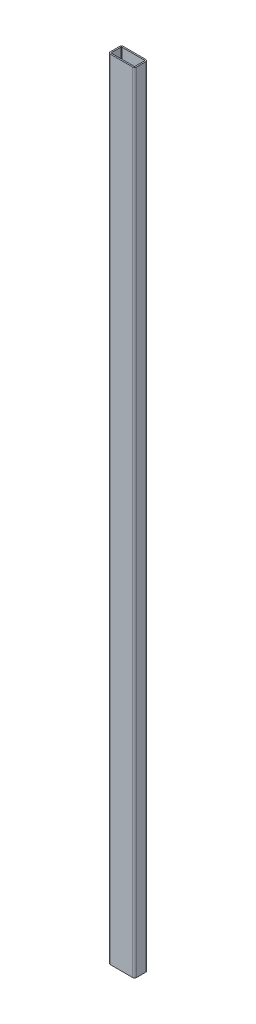
ISO-10303-21;
HEADER;
FILE_DESCRIPTION(('STEP AP214'),'2;1');
FILE_NAME('part.step','',(''),(''),'','','');
FILE_SCHEMA(('AUTOMOTIVE_DESIGN { 1 0 10303 214 1 1 1 1 }'));
ENDSEC;
DATA;
#1=APPLICATION_CONTEXT('core data for automotive mechanical design processes');
#2=APPLICATION_PROTOCOL_DEFINITION('international standard','automotive_design',2000,#1);
#3=PRODUCT_CONTEXT('',#1,'mechanical');
#4=PRODUCT('Part','Part','',(#3));
#5=PRODUCT_RELATED_PRODUCT_CATEGORY('part','',(#4));
#6=PRODUCT_DEFINITION_FORMATION('','',#4);
#7=PRODUCT_DEFINITION_CONTEXT('part definition',#1,'design');
#8=PRODUCT_DEFINITION('design','',#6,#7);
#9=PRODUCT_DEFINITION_SHAPE('','',#8);
#10=(LENGTH_UNIT() NAMED_UNIT(*) SI_UNIT(.MILLI.,.METRE.));
#11=(NAMED_UNIT(*) PLANE_ANGLE_UNIT() SI_UNIT($,.RADIAN.));
#12=(NAMED_UNIT(*) SI_UNIT($,.STERADIAN.) SOLID_ANGLE_UNIT());
#13=UNCERTAINTY_MEASURE_WITH_UNIT(LENGTH_MEASURE(1.E-05),#10,'distance_accuracy_value','');
#14=(GEOMETRIC_REPRESENTATION_CONTEXT(3) GLOBAL_UNCERTAINTY_ASSIGNED_CONTEXT((#13)) GLOBAL_UNIT_ASSIGNED_CONTEXT((#10,
#11,#12)) REPRESENTATION_CONTEXT('',''));
#15=CARTESIAN_POINT('',(0.,0.,0.));
#16=DIRECTION('',(0.,0.,1.));
#17=DIRECTION('',(1.,0.,0.));
#18=AXIS2_PLACEMENT_3D('',#15,#16,#17);
#19=CARTESIAN_POINT('',(37.,1200.,-3.));
#20=DIRECTION('',(0.,1.,0.));
#21=DIRECTION('',(0.,0.,1.));
#22=AXIS2_PLACEMENT_3D('',#19,#20,#21);
#23=PLANE('',#22);
#24=CARTESIAN_POINT('',(37.,1200.,-3.));
#25=DIRECTION('',(0.,1.,0.));
#26=DIRECTION('',(0.,0.,1.));
#27=AXIS2_PLACEMENT_3D('',#24,#25,#26);
#28=CIRCLE('',#27,3.);
#29=CARTESIAN_POINT('',(37.,1200.,0.));
#30=VERTEX_POINT('',#29);
#31=CARTESIAN_POINT('',(40.,1200.,-3.00000000000002));
#32=VERTEX_POINT('',#31);
#33=EDGE_CURVE('E262',#30,#32,#28,.T.);
#34=ORIENTED_EDGE('',*,*,#33,.T.);
#35=DIRECTION('',(0.,0.,-1.));
#36=VECTOR('',#35,1.);
#37=CARTESIAN_POINT('',(40.,1200.,-3.00000000000002));
#38=LINE('',#37,#36);
#39=CARTESIAN_POINT('',(40.,1200.,-17.));
#40=VERTEX_POINT('',#39);
#41=EDGE_CURVE('E265',#32,#40,#38,.T.);
#42=ORIENTED_EDGE('',*,*,#41,.T.);
#43=CARTESIAN_POINT('',(37.,1200.,-17.));
#44=DIRECTION('',(0.,1.,0.));
#45=DIRECTION('',(0.,0.,1.));
#46=AXIS2_PLACEMENT_3D('',#43,#44,#45);
#47=CIRCLE('',#46,3.);
#48=CARTESIAN_POINT('',(37.,1200.,-20.));
#49=VERTEX_POINT('',#48);
#50=EDGE_CURVE('E268',#40,#49,#47,.T.);
#51=ORIENTED_EDGE('',*,*,#50,.T.);
#52=DIRECTION('',(-1.,0.,0.));
#53=VECTOR('',#52,1.);
#54=CARTESIAN_POINT('',(3.00000000000002,1200.,-20.));
#55=LINE('',#54,#53);
#56=CARTESIAN_POINT('',(3.,1200.,-20.));
#57=VERTEX_POINT('',#56);
#58=EDGE_CURVE('E270',#49,#57,#55,.T.);
#59=ORIENTED_EDGE('',*,*,#58,.T.);
#60=CARTESIAN_POINT('',(3.,1200.,-17.));
#61=DIRECTION('',(0.,1.,0.));
#62=DIRECTION('',(0.,0.,-1.));
#63=AXIS2_PLACEMENT_3D('',#60,#61,#62);
#64=CIRCLE('',#63,3.);
#65=CARTESIAN_POINT('',(0.,1200.,-17.));
#66=VERTEX_POINT('',#65);
#67=EDGE_CURVE('E272',#57,#66,#64,.T.);
#68=ORIENTED_EDGE('',*,*,#67,.T.);
#69=DIRECTION('',(0.,0.,1.));
#70=VECTOR('',#69,1.);
#71=CARTESIAN_POINT('',(0.,1200.,-3.00000000000002));
#72=LINE('',#71,#70);
#73=CARTESIAN_POINT('',(0.,1200.,-3.00000000000002));
#74=VERTEX_POINT('',#73);
#75=EDGE_CURVE('E274',#66,#74,#72,.T.);
#76=ORIENTED_EDGE('',*,*,#75,.T.);
#77=CARTESIAN_POINT('',(3.,1200.,-3.));
#78=DIRECTION('',(0.,1.,0.));
#79=DIRECTION('',(0.,0.,1.));
#80=AXIS2_PLACEMENT_3D('',#77,#78,#79);
#81=CIRCLE('',#80,3.);
#82=CARTESIAN_POINT('',(3.00000000000002,1200.,0.));
#83=VERTEX_POINT('',#82);
#84=EDGE_CURVE('E276',#74,#83,#81,.T.);
#85=ORIENTED_EDGE('',*,*,#84,.T.);
#86=DIRECTION('',(1.,0.,0.));
#87=VECTOR('',#86,1.);
#88=CARTESIAN_POINT('',(3.00000000000002,1200.,0.));
#89=LINE('',#88,#87);
#90=EDGE_CURVE('E278',#83,#30,#89,.T.);
#91=ORIENTED_EDGE('',*,*,#90,.T.);
#92=EDGE_LOOP('',(#34,#42,#51,#59,#68,#76,#85,#91));
#93=FACE_BOUND('',#92,.T.);
#94=DIRECTION('',(0.,0.,-1.));
#95=VECTOR('',#94,1.);
#96=CARTESIAN_POINT('',(38.,1200.,-3.00000000000002));
#97=LINE('',#96,#95);
#98=CARTESIAN_POINT('',(38.,1200.,-3.00000000000002));
#99=VERTEX_POINT('',#98);
#100=CARTESIAN_POINT('',(38.,1200.,-17.));
#101=VERTEX_POINT('',#100);
#102=EDGE_CURVE('E205',#99,#101,#97,.T.);
#103=ORIENTED_EDGE('',*,*,#102,.F.);
#104=CARTESIAN_POINT('',(37.,1200.,-3.));
#105=DIRECTION('',(0.,1.,0.));
#106=DIRECTION('',(1.,0.,0.));
#107=AXIS2_PLACEMENT_3D('',#104,#105,#106);
#108=CIRCLE('',#107,1.);
#109=CARTESIAN_POINT('',(37.,1200.,-2.));
#110=VERTEX_POINT('',#109);
#111=EDGE_CURVE('E197',#110,#99,#108,.T.);
#112=ORIENTED_EDGE('',*,*,#111,.F.);
#113=DIRECTION('',(1.,0.,0.));
#114=VECTOR('',#113,1.);
#115=CARTESIAN_POINT('',(3.00000000000002,1200.,-2.));
#116=LINE('',#115,#114);
#117=CARTESIAN_POINT('',(3.00000000000001,1200.,-2.));
#118=VERTEX_POINT('',#117);
#119=EDGE_CURVE('E230',#118,#110,#116,.T.);
#120=ORIENTED_EDGE('',*,*,#119,.F.);
#121=CARTESIAN_POINT('',(3.,1200.,-3.));
#122=DIRECTION('',(0.,1.,0.));
#123=DIRECTION('',(1.,0.,0.));
#124=AXIS2_PLACEMENT_3D('',#121,#122,#123);
#125=CIRCLE('',#124,1.);
#126=CARTESIAN_POINT('',(2.,1200.,-3.00000000000002));
#127=VERTEX_POINT('',#126);
#128=EDGE_CURVE('E228',#127,#118,#125,.T.);
#129=ORIENTED_EDGE('',*,*,#128,.F.);
#130=DIRECTION('',(0.,0.,1.));
#131=VECTOR('',#130,1.);
#132=CARTESIAN_POINT('',(2.,1200.,-3.00000000000002));
#133=LINE('',#132,#131);
#134=CARTESIAN_POINT('',(2.,1200.,-17.));
#135=VERTEX_POINT('',#134);
#136=EDGE_CURVE('E226',#135,#127,#133,.T.);
#137=ORIENTED_EDGE('',*,*,#136,.F.);
#138=CARTESIAN_POINT('',(3.,1200.,-17.));
#139=DIRECTION('',(0.,1.,0.));
#140=DIRECTION('',(1.,0.,0.));
#141=AXIS2_PLACEMENT_3D('',#138,#139,#140);
#142=CIRCLE('',#141,1.);
#143=CARTESIAN_POINT('',(3.,1200.,-18.));
#144=VERTEX_POINT('',#143);
#145=EDGE_CURVE('E224',#144,#135,#142,.T.);
#146=ORIENTED_EDGE('',*,*,#145,.F.);
#147=DIRECTION('',(-1.,0.,0.));
#148=VECTOR('',#147,1.);
#149=CARTESIAN_POINT('',(3.00000000000002,1200.,-18.));
#150=LINE('',#149,#148);
#151=CARTESIAN_POINT('',(37.,1200.,-18.));
#152=VERTEX_POINT('',#151);
#153=EDGE_CURVE('E220',#152,#144,#150,.T.);
#154=ORIENTED_EDGE('',*,*,#153,.F.);
#155=CARTESIAN_POINT('',(37.,1200.,-17.));
#156=DIRECTION('',(0.,1.,0.));
#157=DIRECTION('',(1.,0.,0.));
#158=AXIS2_PLACEMENT_3D('',#155,#156,#157);
#159=CIRCLE('',#158,1.);
#160=EDGE_CURVE('E218',#101,#152,#159,.T.);
#161=ORIENTED_EDGE('',*,*,#160,.F.);
#162=EDGE_LOOP('',(#103,#112,#120,#129,#137,#146,#154,#161));
#163=FACE_BOUND('',#162,.T.);
#164=ADVANCED_FACE('F84',(#93,#163),#23,.T.);
#165=CARTESIAN_POINT('',(37.,0.,-3.));
#166=DIRECTION('',(0.,1.,0.));
#167=DIRECTION('',(0.,0.,1.));
#168=AXIS2_PLACEMENT_3D('',#165,#166,#167);
#169=PLANE('',#168);
#170=CARTESIAN_POINT('',(37.,0.,-3.));
#171=DIRECTION('',(0.,1.,0.));
#172=DIRECTION('',(0.,0.,1.));
#173=AXIS2_PLACEMENT_3D('',#170,#171,#172);
#174=CIRCLE('',#173,3.);
#175=CARTESIAN_POINT('',(37.,0.,0.));
#176=VERTEX_POINT('',#175);
#177=CARTESIAN_POINT('',(40.,0.,-3.00000000000002));
#178=VERTEX_POINT('',#177);
#179=EDGE_CURVE('E213',#176,#178,#174,.T.);
#180=ORIENTED_EDGE('',*,*,#179,.F.);
#181=DIRECTION('',(1.,0.,0.));
#182=VECTOR('',#181,1.);
#183=CARTESIAN_POINT('',(3.00000000000002,0.,0.));
#184=LINE('',#183,#182);
#185=CARTESIAN_POINT('',(3.00000000000002,0.,0.));
#186=VERTEX_POINT('',#185);
#187=EDGE_CURVE('E266',#186,#176,#184,.T.);
#188=ORIENTED_EDGE('',*,*,#187,.F.);
#189=CARTESIAN_POINT('',(3.,0.,-3.));
#190=DIRECTION('',(0.,1.,0.));
#191=DIRECTION('',(0.,0.,1.));
#192=AXIS2_PLACEMENT_3D('',#189,#190,#191);
#193=CIRCLE('',#192,3.);
#194=CARTESIAN_POINT('',(0.,0.,-3.00000000000002));
#195=VERTEX_POINT('',#194);
#196=EDGE_CURVE('E293',#195,#186,#193,.T.);
#197=ORIENTED_EDGE('',*,*,#196,.F.);
#198=DIRECTION('',(0.,0.,1.));
#199=VECTOR('',#198,1.);
#200=CARTESIAN_POINT('',(0.,0.,-3.00000000000002));
#201=LINE('',#200,#199);
#202=CARTESIAN_POINT('',(0.,0.,-17.));
#203=VERTEX_POINT('',#202);
#204=EDGE_CURVE('E291',#203,#195,#201,.T.);
#205=ORIENTED_EDGE('',*,*,#204,.F.);
#206=CARTESIAN_POINT('',(3.,0.,-17.));
#207=DIRECTION('',(0.,1.,0.));
#208=DIRECTION('',(0.,0.,-1.));
#209=AXIS2_PLACEMENT_3D('',#206,#207,#208);
#210=CIRCLE('',#209,3.);
#211=CARTESIAN_POINT('',(3.,0.,-20.));
#212=VERTEX_POINT('',#211);
#213=EDGE_CURVE('E289',#212,#203,#210,.T.);
#214=ORIENTED_EDGE('',*,*,#213,.F.);
#215=DIRECTION('',(-1.,0.,0.));
#216=VECTOR('',#215,1.);
#217=CARTESIAN_POINT('',(3.00000000000002,0.,-20.));
#218=LINE('',#217,#216);
#219=CARTESIAN_POINT('',(37.,0.,-20.));
#220=VERTEX_POINT('',#219);
#221=EDGE_CURVE('E287',#220,#212,#218,.T.);
#222=ORIENTED_EDGE('',*,*,#221,.F.);
#223=CARTESIAN_POINT('',(37.,0.,-17.));
#224=DIRECTION('',(0.,1.,0.));
#225=DIRECTION('',(0.,0.,1.));
#226=AXIS2_PLACEMENT_3D('',#223,#224,#225);
#227=CIRCLE('',#226,3.);
#228=CARTESIAN_POINT('',(40.,0.,-17.));
#229=VERTEX_POINT('',#228);
#230=EDGE_CURVE('E285',#229,#220,#227,.T.);
#231=ORIENTED_EDGE('',*,*,#230,.F.);
#232=DIRECTION('',(0.,0.,-1.));
#233=VECTOR('',#232,1.);
#234=CARTESIAN_POINT('',(40.,0.,-3.00000000000002));
#235=LINE('',#234,#233);
#236=EDGE_CURVE('E283',#178,#229,#235,.T.);
#237=ORIENTED_EDGE('',*,*,#236,.F.);
#238=EDGE_LOOP('',(#180,#188,#197,#205,#214,#222,#231,#237));
#239=FACE_BOUND('',#238,.T.);
#240=CARTESIAN_POINT('',(37.,0.,-3.));
#241=DIRECTION('',(0.,1.,0.));
#242=DIRECTION('',(1.,0.,0.));
#243=AXIS2_PLACEMENT_3D('',#240,#241,#242);
#244=CIRCLE('',#243,1.);
#245=CARTESIAN_POINT('',(37.,0.,-2.));
#246=VERTEX_POINT('',#245);
#247=CARTESIAN_POINT('',(38.,0.,-3.00000000000002));
#248=VERTEX_POINT('',#247);
#249=EDGE_CURVE('E107',#246,#248,#244,.T.);
#250=ORIENTED_EDGE('',*,*,#249,.T.);
#251=DIRECTION('',(0.,0.,-1.));
#252=VECTOR('',#251,1.);
#253=CARTESIAN_POINT('',(38.,0.,-3.00000000000002));
#254=LINE('',#253,#252);
#255=CARTESIAN_POINT('',(38.,0.,-17.));
#256=VERTEX_POINT('',#255);
#257=EDGE_CURVE('E212',#248,#256,#254,.T.);
#258=ORIENTED_EDGE('',*,*,#257,.T.);
#259=CARTESIAN_POINT('',(37.,0.,-17.));
#260=DIRECTION('',(0.,1.,0.));
#261=DIRECTION('',(1.,0.,0.));
#262=AXIS2_PLACEMENT_3D('',#259,#260,#261);
#263=CIRCLE('',#262,1.);
#264=CARTESIAN_POINT('',(37.,0.,-18.));
#265=VERTEX_POINT('',#264);
#266=EDGE_CURVE('E234',#256,#265,#263,.T.);
#267=ORIENTED_EDGE('',*,*,#266,.T.);
#268=DIRECTION('',(-1.,0.,0.));
#269=VECTOR('',#268,1.);
#270=CARTESIAN_POINT('',(3.00000000000002,0.,-18.));
#271=LINE('',#270,#269);
#272=CARTESIAN_POINT('',(3.,0.,-18.));
#273=VERTEX_POINT('',#272);
#274=EDGE_CURVE('E237',#265,#273,#271,.T.);
#275=ORIENTED_EDGE('',*,*,#274,.T.);
#276=CARTESIAN_POINT('',(3.,0.,-17.));
#277=DIRECTION('',(0.,1.,0.));
#278=DIRECTION('',(1.,0.,0.));
#279=AXIS2_PLACEMENT_3D('',#276,#277,#278);
#280=CIRCLE('',#279,1.);
#281=CARTESIAN_POINT('',(2.,0.,-17.));
#282=VERTEX_POINT('',#281);
#283=EDGE_CURVE('E240',#273,#282,#280,.T.);
#284=ORIENTED_EDGE('',*,*,#283,.T.);
#285=DIRECTION('',(0.,0.,1.));
#286=VECTOR('',#285,1.);
#287=CARTESIAN_POINT('',(2.,0.,-3.00000000000002));
#288=LINE('',#287,#286);
#289=CARTESIAN_POINT('',(2.,0.,-3.00000000000002));
#290=VERTEX_POINT('',#289);
#291=EDGE_CURVE('E243',#282,#290,#288,.T.);
#292=ORIENTED_EDGE('',*,*,#291,.T.);
#293=CARTESIAN_POINT('',(3.,0.,-3.));
#294=DIRECTION('',(0.,1.,0.));
#295=DIRECTION('',(1.,0.,0.));
#296=AXIS2_PLACEMENT_3D('',#293,#294,#295);
#297=CIRCLE('',#296,1.);
#298=CARTESIAN_POINT('',(3.00000000000001,0.,-2.));
#299=VERTEX_POINT('',#298);
#300=EDGE_CURVE('E246',#290,#299,#297,.T.);
#301=ORIENTED_EDGE('',*,*,#300,.T.);
#302=DIRECTION('',(1.,0.,0.));
#303=VECTOR('',#302,1.);
#304=CARTESIAN_POINT('',(3.00000000000002,0.,-2.));
#305=LINE('',#304,#303);
#306=EDGE_CURVE('E206',#299,#246,#305,.T.);
#307=ORIENTED_EDGE('',*,*,#306,.T.);
#308=EDGE_LOOP('',(#250,#258,#267,#275,#284,#292,#301,#307));
#309=FACE_BOUND('',#308,.T.);
#310=ADVANCED_FACE('F323',(#239,#309),#169,.F.);
#311=CARTESIAN_POINT('',(37.,1200.,-3.));
#312=DIRECTION('',(0.,-1.,0.));
#313=DIRECTION('',(0.,0.,-1.));
#314=AXIS2_PLACEMENT_3D('',#311,#312,#313);
#315=CYLINDRICAL_SURFACE('',#314,3.);
#316=ORIENTED_EDGE('',*,*,#179,.T.);
#317=DIRECTION('',(0.,-1.,0.));
#318=VECTOR('',#317,1.);
#319=CARTESIAN_POINT('',(40.,1200.,-3.00000000000002));
#320=LINE('',#319,#318);
#321=EDGE_CURVE('E12',#32,#178,#320,.T.);
#322=ORIENTED_EDGE('',*,*,#321,.F.);
#323=ORIENTED_EDGE('',*,*,#33,.F.);
#324=DIRECTION('',(0.,-1.,0.));
#325=VECTOR('',#324,1.);
#326=CARTESIAN_POINT('',(37.,1200.,0.));
#327=LINE('',#326,#325);
#328=EDGE_CURVE('E280',#30,#176,#327,.T.);
#329=ORIENTED_EDGE('',*,*,#328,.T.);
#330=EDGE_LOOP('',(#316,#322,#323,#329));
#331=FACE_BOUND('',#330,.T.);
#332=ADVANCED_FACE('F86',(#331),#315,.T.);
#333=CARTESIAN_POINT('',(40.,1200.,-3.00000000000002));
#334=DIRECTION('',(-1.,0.,0.));
#335=DIRECTION('',(0.,0.,1.));
#336=AXIS2_PLACEMENT_3D('',#333,#334,#335);
#337=PLANE('',#336);
#338=ORIENTED_EDGE('',*,*,#236,.T.);
#339=DIRECTION('',(0.,-1.,0.));
#340=VECTOR('',#339,1.);
#341=CARTESIAN_POINT('',(40.,1200.,-17.));
#342=LINE('',#341,#340);
#343=EDGE_CURVE('E92',#40,#229,#342,.T.);
#344=ORIENTED_EDGE('',*,*,#343,.F.);
#345=ORIENTED_EDGE('',*,*,#41,.F.);
#346=ORIENTED_EDGE('',*,*,#321,.T.);
#347=EDGE_LOOP('',(#338,#344,#345,#346));
#348=FACE_BOUND('',#347,.T.);
#349=ADVANCED_FACE('F340',(#348),#337,.F.);
#350=CARTESIAN_POINT('',(37.,1200.,-17.));
#351=DIRECTION('',(0.,-1.,0.));
#352=DIRECTION('',(0.,0.,-1.));
#353=AXIS2_PLACEMENT_3D('',#350,#351,#352);
#354=CYLINDRICAL_SURFACE('',#353,3.);
#355=ORIENTED_EDGE('',*,*,#230,.T.);
#356=DIRECTION('',(0.,-1.,0.));
#357=VECTOR('',#356,1.);
#358=CARTESIAN_POINT('',(37.,1200.,-20.));
#359=LINE('',#358,#357);
#360=EDGE_CURVE('E310',#49,#220,#359,.T.);
#361=ORIENTED_EDGE('',*,*,#360,.F.);
#362=ORIENTED_EDGE('',*,*,#50,.F.);
#363=ORIENTED_EDGE('',*,*,#343,.T.);
#364=EDGE_LOOP('',(#355,#361,#362,#363));
#365=FACE_BOUND('',#364,.T.);
#366=ADVANCED_FACE('F317',(#365),#354,.T.);
#367=CARTESIAN_POINT('',(3.00000000000002,1200.,-20.));
#368=DIRECTION('',(0.,0.,1.));
#369=DIRECTION('',(1.,0.,0.));
#370=AXIS2_PLACEMENT_3D('',#367,#368,#369);
#371=PLANE('',#370);
#372=ORIENTED_EDGE('',*,*,#221,.T.);
#373=DIRECTION('',(0.,-1.,0.));
#374=VECTOR('',#373,1.);
#375=CARTESIAN_POINT('',(3.,1200.,-20.));
#376=LINE('',#375,#374);
#377=EDGE_CURVE('E307',#57,#212,#376,.T.);
#378=ORIENTED_EDGE('',*,*,#377,.F.);
#379=ORIENTED_EDGE('',*,*,#58,.F.);
#380=ORIENTED_EDGE('',*,*,#360,.T.);
#381=EDGE_LOOP('',(#372,#378,#379,#380));
#382=FACE_BOUND('',#381,.T.);
#383=ADVANCED_FACE('F329',(#382),#371,.F.);
#384=CARTESIAN_POINT('',(3.,1200.,-17.));
#385=DIRECTION('',(0.,-1.,0.));
#386=DIRECTION('',(0.,0.,-1.));
#387=AXIS2_PLACEMENT_3D('',#384,#385,#386);
#388=CYLINDRICAL_SURFACE('',#387,3.);
#389=ORIENTED_EDGE('',*,*,#213,.T.);
#390=DIRECTION('',(0.,-1.,0.));
#391=VECTOR('',#390,1.);
#392=CARTESIAN_POINT('',(0.,1200.,-17.));
#393=LINE('',#392,#391);
#394=EDGE_CURVE('E304',#66,#203,#393,.T.);
#395=ORIENTED_EDGE('',*,*,#394,.F.);
#396=ORIENTED_EDGE('',*,*,#67,.F.);
#397=ORIENTED_EDGE('',*,*,#377,.T.);
#398=EDGE_LOOP('',(#389,#395,#396,#397));
#399=FACE_BOUND('',#398,.T.);
#400=ADVANCED_FACE('F333',(#399),#388,.T.);
#401=CARTESIAN_POINT('',(0.,1200.,-3.00000000000002));
#402=DIRECTION('',(1.,0.,0.));
#403=DIRECTION('',(0.,0.,-1.));
#404=AXIS2_PLACEMENT_3D('',#401,#402,#403);
#405=PLANE('',#404);
#406=ORIENTED_EDGE('',*,*,#204,.T.);
#407=DIRECTION('',(0.,-1.,0.));
#408=VECTOR('',#407,1.);
#409=CARTESIAN_POINT('',(0.,1200.,-3.00000000000002));
#410=LINE('',#409,#408);
#411=EDGE_CURVE('E301',#74,#195,#410,.T.);
#412=ORIENTED_EDGE('',*,*,#411,.F.);
#413=ORIENTED_EDGE('',*,*,#75,.F.);
#414=ORIENTED_EDGE('',*,*,#394,.T.);
#415=EDGE_LOOP('',(#406,#412,#413,#414));
#416=FACE_BOUND('',#415,.T.);
#417=ADVANCED_FACE('F353',(#416),#405,.F.);
#418=CARTESIAN_POINT('',(3.,1200.,-3.));
#419=DIRECTION('',(0.,-1.,0.));
#420=DIRECTION('',(0.,0.,-1.));
#421=AXIS2_PLACEMENT_3D('',#418,#419,#420);
#422=CYLINDRICAL_SURFACE('',#421,3.);
#423=ORIENTED_EDGE('',*,*,#196,.T.);
#424=DIRECTION('',(0.,-1.,0.));
#425=VECTOR('',#424,1.);
#426=CARTESIAN_POINT('',(3.00000000000002,1200.,0.));
#427=LINE('',#426,#425);
#428=EDGE_CURVE('E298',#83,#186,#427,.T.);
#429=ORIENTED_EDGE('',*,*,#428,.F.);
#430=ORIENTED_EDGE('',*,*,#84,.F.);
#431=ORIENTED_EDGE('',*,*,#411,.T.);
#432=EDGE_LOOP('',(#423,#429,#430,#431));
#433=FACE_BOUND('',#432,.T.);
#434=ADVANCED_FACE('F351',(#433),#422,.T.);
#435=CARTESIAN_POINT('',(3.00000000000002,1200.,0.));
#436=DIRECTION('',(0.,0.,-1.));
#437=DIRECTION('',(-1.,0.,0.));
#438=AXIS2_PLACEMENT_3D('',#435,#436,#437);
#439=PLANE('',#438);
#440=ORIENTED_EDGE('',*,*,#187,.T.);
#441=ORIENTED_EDGE('',*,*,#328,.F.);
#442=ORIENTED_EDGE('',*,*,#90,.F.);
#443=ORIENTED_EDGE('',*,*,#428,.T.);
#444=EDGE_LOOP('',(#440,#441,#442,#443));
#445=FACE_BOUND('',#444,.T.);
#446=ADVANCED_FACE('F346',(#445),#439,.F.);
#447=CARTESIAN_POINT('',(37.,1200.,-3.));
#448=DIRECTION('',(0.,-1.,0.));
#449=DIRECTION('',(0.,0.,-1.));
#450=AXIS2_PLACEMENT_3D('',#447,#448,#449);
#451=CYLINDRICAL_SURFACE('',#450,1.);
#452=ORIENTED_EDGE('',*,*,#249,.F.);
#453=DIRECTION('',(0.,-1.,0.));
#454=VECTOR('',#453,1.);
#455=CARTESIAN_POINT('',(37.,1200.,-2.));
#456=LINE('',#455,#454);
#457=EDGE_CURVE('E201',#110,#246,#456,.T.);
#458=ORIENTED_EDGE('',*,*,#457,.F.);
#459=ORIENTED_EDGE('',*,*,#111,.T.);
#460=DIRECTION('',(0.,-1.,0.));
#461=VECTOR('',#460,1.);
#462=CARTESIAN_POINT('',(38.,1200.,-3.00000000000002));
#463=LINE('',#462,#461);
#464=EDGE_CURVE('E200',#99,#248,#463,.T.);
#465=ORIENTED_EDGE('',*,*,#464,.T.);
#466=EDGE_LOOP('',(#452,#458,#459,#465));
#467=FACE_BOUND('',#466,.T.);
#468=ADVANCED_FACE('F199',(#467),#451,.F.);
#469=CARTESIAN_POINT('',(38.,1200.,-3.00000000000002));
#470=DIRECTION('',(-1.,0.,0.));
#471=DIRECTION('',(0.,0.,1.));
#472=AXIS2_PLACEMENT_3D('',#469,#470,#471);
#473=PLANE('',#472);
#474=ORIENTED_EDGE('',*,*,#257,.F.);
#475=ORIENTED_EDGE('',*,*,#464,.F.);
#476=ORIENTED_EDGE('',*,*,#102,.T.);
#477=DIRECTION('',(0.,-1.,0.));
#478=VECTOR('',#477,1.);
#479=CARTESIAN_POINT('',(38.,1200.,-17.));
#480=LINE('',#479,#478);
#481=EDGE_CURVE('E214',#101,#256,#480,.T.);
#482=ORIENTED_EDGE('',*,*,#481,.T.);
#483=EDGE_LOOP('',(#474,#475,#476,#482));
#484=FACE_BOUND('',#483,.T.);
#485=ADVANCED_FACE('F209',(#484),#473,.T.);
#486=CARTESIAN_POINT('',(37.,1200.,-17.));
#487=DIRECTION('',(0.,-1.,0.));
#488=DIRECTION('',(0.,0.,-1.));
#489=AXIS2_PLACEMENT_3D('',#486,#487,#488);
#490=CYLINDRICAL_SURFACE('',#489,1.);
#491=ORIENTED_EDGE('',*,*,#266,.F.);
#492=ORIENTED_EDGE('',*,*,#481,.F.);
#493=ORIENTED_EDGE('',*,*,#160,.T.);
#494=DIRECTION('',(0.,-1.,0.));
#495=VECTOR('',#494,1.);
#496=CARTESIAN_POINT('',(37.,1200.,-18.));
#497=LINE('',#496,#495);
#498=EDGE_CURVE('E259',#152,#265,#497,.T.);
#499=ORIENTED_EDGE('',*,*,#498,.T.);
#500=EDGE_LOOP('',(#491,#492,#493,#499));
#501=FACE_BOUND('',#500,.T.);
#502=ADVANCED_FACE('F378',(#501),#490,.F.);
#503=CARTESIAN_POINT('',(3.00000000000002,1200.,-18.));
#504=DIRECTION('',(0.,0.,1.));
#505=DIRECTION('',(1.,0.,0.));
#506=AXIS2_PLACEMENT_3D('',#503,#504,#505);
#507=PLANE('',#506);
#508=ORIENTED_EDGE('',*,*,#274,.F.);
#509=ORIENTED_EDGE('',*,*,#498,.F.);
#510=ORIENTED_EDGE('',*,*,#153,.T.);
#511=DIRECTION('',(0.,-1.,0.));
#512=VECTOR('',#511,1.);
#513=CARTESIAN_POINT('',(3.,1200.,-18.));
#514=LINE('',#513,#512);
#515=EDGE_CURVE('E257',#144,#273,#514,.T.);
#516=ORIENTED_EDGE('',*,*,#515,.T.);
#517=EDGE_LOOP('',(#508,#509,#510,#516));
#518=FACE_BOUND('',#517,.T.);
#519=ADVANCED_FACE('F382',(#518),#507,.T.);
#520=CARTESIAN_POINT('',(3.,1200.,-17.));
#521=DIRECTION('',(0.,-1.,0.));
#522=DIRECTION('',(0.,0.,-1.));
#523=AXIS2_PLACEMENT_3D('',#520,#521,#522);
#524=CYLINDRICAL_SURFACE('',#523,1.);
#525=ORIENTED_EDGE('',*,*,#283,.F.);
#526=ORIENTED_EDGE('',*,*,#515,.F.);
#527=ORIENTED_EDGE('',*,*,#145,.T.);
#528=DIRECTION('',(0.,-1.,0.));
#529=VECTOR('',#528,1.);
#530=CARTESIAN_POINT('',(2.,1200.,-17.));
#531=LINE('',#530,#529);
#532=EDGE_CURVE('E255',#135,#282,#531,.T.);
#533=ORIENTED_EDGE('',*,*,#532,.T.);
#534=EDGE_LOOP('',(#525,#526,#527,#533));
#535=FACE_BOUND('',#534,.T.);
#536=ADVANCED_FACE('F388',(#535),#524,.F.);
#537=CARTESIAN_POINT('',(2.,1200.,-3.00000000000002));
#538=DIRECTION('',(1.,0.,0.));
#539=DIRECTION('',(0.,0.,-1.));
#540=AXIS2_PLACEMENT_3D('',#537,#538,#539);
#541=PLANE('',#540);
#542=ORIENTED_EDGE('',*,*,#291,.F.);
#543=ORIENTED_EDGE('',*,*,#532,.F.);
#544=ORIENTED_EDGE('',*,*,#136,.T.);
#545=DIRECTION('',(0.,-1.,0.));
#546=VECTOR('',#545,1.);
#547=CARTESIAN_POINT('',(2.,1200.,-3.00000000000002));
#548=LINE('',#547,#546);
#549=EDGE_CURVE('E253',#127,#290,#548,.T.);
#550=ORIENTED_EDGE('',*,*,#549,.T.);
#551=EDGE_LOOP('',(#542,#543,#544,#550));
#552=FACE_BOUND('',#551,.T.);
#553=ADVANCED_FACE('F392',(#552),#541,.T.);
#554=CARTESIAN_POINT('',(3.,1200.,-3.));
#555=DIRECTION('',(0.,-1.,0.));
#556=DIRECTION('',(0.,0.,-1.));
#557=AXIS2_PLACEMENT_3D('',#554,#555,#556);
#558=CYLINDRICAL_SURFACE('',#557,1.);
#559=ORIENTED_EDGE('',*,*,#300,.F.);
#560=ORIENTED_EDGE('',*,*,#549,.F.);
#561=ORIENTED_EDGE('',*,*,#128,.T.);
#562=DIRECTION('',(0.,-1.,0.));
#563=VECTOR('',#562,1.);
#564=CARTESIAN_POINT('',(3.00000000000001,1200.,-2.));
#565=LINE('',#564,#563);
#566=EDGE_CURVE('E99',#118,#299,#565,.T.);
#567=ORIENTED_EDGE('',*,*,#566,.T.);
#568=EDGE_LOOP('',(#559,#560,#561,#567));
#569=FACE_BOUND('',#568,.T.);
#570=ADVANCED_FACE('F396',(#569),#558,.F.);
#571=CARTESIAN_POINT('',(3.00000000000002,1200.,-2.));
#572=DIRECTION('',(0.,0.,-1.));
#573=DIRECTION('',(-1.,0.,0.));
#574=AXIS2_PLACEMENT_3D('',#571,#572,#573);
#575=PLANE('',#574);
#576=ORIENTED_EDGE('',*,*,#306,.F.);
#577=ORIENTED_EDGE('',*,*,#566,.F.);
#578=ORIENTED_EDGE('',*,*,#119,.T.);
#579=ORIENTED_EDGE('',*,*,#457,.T.);
#580=EDGE_LOOP('',(#576,#577,#578,#579));
#581=FACE_BOUND('',#580,.T.);
#582=ADVANCED_FACE('F400',(#581),#575,.T.);
#583=CLOSED_SHELL('',(#164,#310,#332,#349,#366,#383,#400,#417,#434,#446,#468,#485,#502,#519,
#536,#553,#570,#582));
#584=MANIFOLD_SOLID_BREP('B2',#583);
#585=ADVANCED_BREP_SHAPE_REPRESENTATION('',(#18,#584),#14);
#586=SHAPE_DEFINITION_REPRESENTATION(#9,#585);
ENDSEC;
END-ISO-10303-21;
